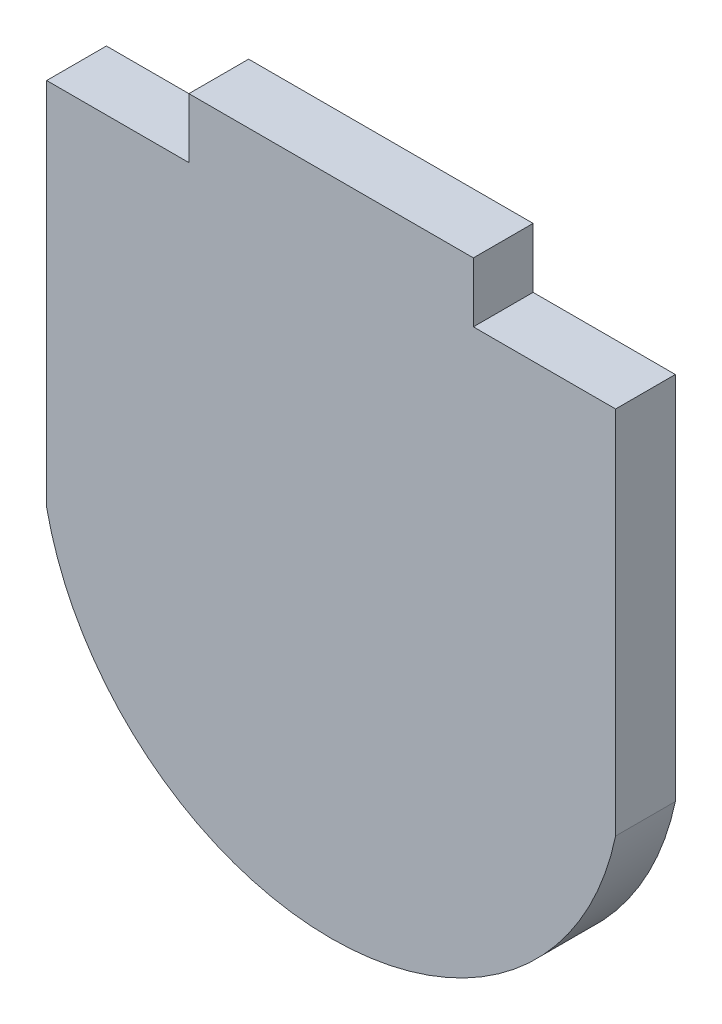
ISO-10303-21;
HEADER;
FILE_DESCRIPTION(('STEP AP214'),'2;1');
FILE_NAME('part.step','',(''),(''),'','','');
FILE_SCHEMA(('AUTOMOTIVE_DESIGN { 1 0 10303 214 1 1 1 1 }'));
ENDSEC;
DATA;
#1=APPLICATION_CONTEXT('core data for automotive mechanical design processes');
#2=APPLICATION_PROTOCOL_DEFINITION('international standard','automotive_design',2000,#1);
#3=PRODUCT_CONTEXT('',#1,'mechanical');
#4=PRODUCT('Part','Part','',(#3));
#5=PRODUCT_RELATED_PRODUCT_CATEGORY('part','',(#4));
#6=PRODUCT_DEFINITION_FORMATION('','',#4);
#7=PRODUCT_DEFINITION_CONTEXT('part definition',#1,'design');
#8=PRODUCT_DEFINITION('design','',#6,#7);
#9=PRODUCT_DEFINITION_SHAPE('','',#8);
#10=(LENGTH_UNIT() NAMED_UNIT(*) SI_UNIT(.MILLI.,.METRE.));
#11=(NAMED_UNIT(*) PLANE_ANGLE_UNIT() SI_UNIT($,.RADIAN.));
#12=(NAMED_UNIT(*) SI_UNIT($,.STERADIAN.) SOLID_ANGLE_UNIT());
#13=UNCERTAINTY_MEASURE_WITH_UNIT(LENGTH_MEASURE(1.E-05),#10,'distance_accuracy_value','');
#14=(GEOMETRIC_REPRESENTATION_CONTEXT(3) GLOBAL_UNCERTAINTY_ASSIGNED_CONTEXT((#13)) GLOBAL_UNIT_ASSIGNED_CONTEXT((#10,
#11,#12)) REPRESENTATION_CONTEXT('',''));
#15=CARTESIAN_POINT('',(0.,0.,0.));
#16=DIRECTION('',(0.,0.,1.));
#17=DIRECTION('',(1.,0.,0.));
#18=AXIS2_PLACEMENT_3D('',#15,#16,#17);
#19=CARTESIAN_POINT('',(-12.7210262479196,65.0700055953499,5.334));
#20=DIRECTION('',(0.,0.,-1.));
#21=DIRECTION('',(-1.,0.,0.));
#22=AXIS2_PLACEMENT_3D('',#19,#20,#21);
#23=CYLINDRICAL_SURFACE('',#22,25.9540277413738);
#24=CARTESIAN_POINT('',(-12.7210262479196,65.0700055953499,0.));
#25=DIRECTION('',(0.,0.,1.));
#26=DIRECTION('',(1.,0.,0.));
#27=AXIS2_PLACEMENT_3D('',#24,#25,#26);
#28=CIRCLE('',#27,25.9540277413738);
#29=CARTESIAN_POINT('',(-38.1210262479196,59.7360055953499,0.));
#30=VERTEX_POINT('',#29);
#31=CARTESIAN_POINT('',(12.6789737520804,59.7360055953498,0.));
#32=VERTEX_POINT('',#31);
#33=EDGE_CURVE('E122',#30,#32,#28,.T.);
#34=ORIENTED_EDGE('',*,*,#33,.T.);
#35=DIRECTION('',(0.,0.,-1.));
#36=VECTOR('',#35,1.);
#37=CARTESIAN_POINT('',(12.6789737520804,59.7360055953498,5.334));
#38=LINE('',#37,#36);
#39=CARTESIAN_POINT('',(12.6789737520804,59.7360055953498,5.334));
#40=VERTEX_POINT('',#39);
#41=EDGE_CURVE('E11',#40,#32,#38,.T.);
#42=ORIENTED_EDGE('',*,*,#41,.F.);
#43=CARTESIAN_POINT('',(-12.7210262479196,65.0700055953499,5.334));
#44=DIRECTION('',(0.,0.,1.));
#45=DIRECTION('',(1.,0.,0.));
#46=AXIS2_PLACEMENT_3D('',#43,#44,#45);
#47=CIRCLE('',#46,25.9540277413738);
#48=CARTESIAN_POINT('',(-38.1210262479196,59.7360055953499,5.334));
#49=VERTEX_POINT('',#48);
#50=EDGE_CURVE('E123',#49,#40,#47,.T.);
#51=ORIENTED_EDGE('',*,*,#50,.F.);
#52=DIRECTION('',(0.,0.,-1.));
#53=VECTOR('',#52,1.);
#54=CARTESIAN_POINT('',(-38.1210262479196,59.7360055953499,5.334));
#55=LINE('',#54,#53);
#56=EDGE_CURVE('E44',#49,#30,#55,.T.);
#57=ORIENTED_EDGE('',*,*,#56,.T.);
#58=EDGE_LOOP('',(#34,#42,#51,#57));
#59=FACE_BOUND('',#58,.T.);
#60=ADVANCED_FACE('F37',(#59),#23,.T.);
#61=CARTESIAN_POINT('',(12.6789737520804,98.0900055953499,5.334));
#62=DIRECTION('',(-1.,0.,0.));
#63=DIRECTION('',(0.,-1.,0.));
#64=AXIS2_PLACEMENT_3D('',#61,#62,#63);
#65=PLANE('',#64);
#66=DIRECTION('',(0.,1.,0.));
#67=VECTOR('',#66,1.);
#68=CARTESIAN_POINT('',(12.6789737520804,98.0900055953499,0.));
#69=LINE('',#68,#67);
#70=CARTESIAN_POINT('',(12.6789737520804,92.7560055953499,0.));
#71=VERTEX_POINT('',#70);
#72=EDGE_CURVE('E130',#32,#71,#69,.T.);
#73=ORIENTED_EDGE('',*,*,#72,.T.);
#74=DIRECTION('',(0.,0.,1.));
#75=VECTOR('',#74,1.);
#76=CARTESIAN_POINT('',(12.6789737520804,92.7560055953499,0.));
#77=LINE('',#76,#75);
#78=CARTESIAN_POINT('',(12.6789737520804,92.7560055953499,5.334));
#79=VERTEX_POINT('',#78);
#80=EDGE_CURVE('E147',#71,#79,#77,.T.);
#81=ORIENTED_EDGE('',*,*,#80,.T.);
#82=DIRECTION('',(0.,1.,0.));
#83=VECTOR('',#82,1.);
#84=CARTESIAN_POINT('',(12.6789737520804,98.0900055953499,5.334));
#85=LINE('',#84,#83);
#86=EDGE_CURVE('E127',#40,#79,#85,.T.);
#87=ORIENTED_EDGE('',*,*,#86,.F.);
#88=ORIENTED_EDGE('',*,*,#41,.T.);
#89=EDGE_LOOP('',(#73,#81,#87,#88));
#90=FACE_BOUND('',#89,.T.);
#91=ADVANCED_FACE('F146',(#90),#65,.F.);
#92=CARTESIAN_POINT('',(-38.1210262479196,98.0900055953499,5.334));
#93=DIRECTION('',(0.,-1.,0.));
#94=DIRECTION('',(0.,0.,-1.));
#95=AXIS2_PLACEMENT_3D('',#92,#93,#94);
#96=PLANE('',#95);
#97=DIRECTION('',(-1.,0.,0.));
#98=VECTOR('',#97,1.);
#99=CARTESIAN_POINT('',(-38.1210262479196,98.0900055953499,0.));
#100=LINE('',#99,#98);
#101=CARTESIAN_POINT('',(-0.0210262479196158,98.0900055953499,0.));
#102=VERTEX_POINT('',#101);
#103=CARTESIAN_POINT('',(-25.4210262479196,98.0900055953499,0.));
#104=VERTEX_POINT('',#103);
#105=EDGE_CURVE('E124',#102,#104,#100,.T.);
#106=ORIENTED_EDGE('',*,*,#105,.T.);
#107=DIRECTION('',(0.,0.,1.));
#108=VECTOR('',#107,1.);
#109=CARTESIAN_POINT('',(-25.4210262479196,98.0900055953499,0.));
#110=LINE('',#109,#108);
#111=CARTESIAN_POINT('',(-25.4210262479196,98.0900055953499,5.334));
#112=VERTEX_POINT('',#111);
#113=EDGE_CURVE('E142',#104,#112,#110,.T.);
#114=ORIENTED_EDGE('',*,*,#113,.T.);
#115=DIRECTION('',(-1.,0.,0.));
#116=VECTOR('',#115,1.);
#117=CARTESIAN_POINT('',(-38.1210262479196,98.0900055953499,5.334));
#118=LINE('',#117,#116);
#119=CARTESIAN_POINT('',(-0.0210262479196158,98.0900055953499,5.334));
#120=VERTEX_POINT('',#119);
#121=EDGE_CURVE('E135',#120,#112,#118,.T.);
#122=ORIENTED_EDGE('',*,*,#121,.F.);
#123=DIRECTION('',(0.,0.,1.));
#124=VECTOR('',#123,1.);
#125=CARTESIAN_POINT('',(-0.0210262479196158,98.0900055953499,0.));
#126=LINE('',#125,#124);
#127=EDGE_CURVE('E153',#102,#120,#126,.T.);
#128=ORIENTED_EDGE('',*,*,#127,.F.);
#129=EDGE_LOOP('',(#106,#114,#122,#128));
#130=FACE_BOUND('',#129,.T.);
#131=ADVANCED_FACE('F170',(#130),#96,.F.);
#132=CARTESIAN_POINT('',(-38.1210262479196,59.7360055953499,5.334));
#133=DIRECTION('',(1.,0.,0.));
#134=DIRECTION('',(0.,1.,0.));
#135=AXIS2_PLACEMENT_3D('',#132,#133,#134);
#136=PLANE('',#135);
#137=DIRECTION('',(0.,-1.,0.));
#138=VECTOR('',#137,1.);
#139=CARTESIAN_POINT('',(-38.1210262479196,59.7360055953499,5.334));
#140=LINE('',#139,#138);
#141=CARTESIAN_POINT('',(-38.1210262479196,92.7560055953499,5.334));
#142=VERTEX_POINT('',#141);
#143=EDGE_CURVE('E117',#142,#49,#140,.T.);
#144=ORIENTED_EDGE('',*,*,#143,.F.);
#145=DIRECTION('',(0.,0.,1.));
#146=VECTOR('',#145,1.);
#147=CARTESIAN_POINT('',(-38.1210262479196,92.7560055953499,0.));
#148=LINE('',#147,#146);
#149=CARTESIAN_POINT('',(-38.1210262479196,92.7560055953499,0.));
#150=VERTEX_POINT('',#149);
#151=EDGE_CURVE('E104',#150,#142,#148,.T.);
#152=ORIENTED_EDGE('',*,*,#151,.F.);
#153=DIRECTION('',(0.,-1.,0.));
#154=VECTOR('',#153,1.);
#155=CARTESIAN_POINT('',(-38.1210262479196,59.7360055953499,0.));
#156=LINE('',#155,#154);
#157=EDGE_CURVE('E115',#150,#30,#156,.T.);
#158=ORIENTED_EDGE('',*,*,#157,.T.);
#159=ORIENTED_EDGE('',*,*,#56,.F.);
#160=EDGE_LOOP('',(#144,#152,#158,#159));
#161=FACE_BOUND('',#160,.T.);
#162=ADVANCED_FACE('F113',(#161),#136,.F.);
#163=CARTESIAN_POINT('',(-12.7210262479196,65.0700055953499,5.334));
#164=DIRECTION('',(0.,0.,1.));
#165=DIRECTION('',(1.,0.,0.));
#166=AXIS2_PLACEMENT_3D('',#163,#164,#165);
#167=PLANE('',#166);
#168=DIRECTION('',(0.,1.,0.));
#169=VECTOR('',#168,1.);
#170=CARTESIAN_POINT('',(-25.4210262479196,98.0900055953499,5.334));
#171=LINE('',#170,#169);
#172=CARTESIAN_POINT('',(-25.4210262479196,92.7560055953499,5.334));
#173=VERTEX_POINT('',#172);
#174=EDGE_CURVE('E109',#173,#112,#171,.T.);
#175=ORIENTED_EDGE('',*,*,#174,.F.);
#176=DIRECTION('',(1.,0.,0.));
#177=VECTOR('',#176,1.);
#178=CARTESIAN_POINT('',(-38.1210262479196,92.7560055953499,5.334));
#179=LINE('',#178,#177);
#180=EDGE_CURVE('E197',#142,#173,#179,.T.);
#181=ORIENTED_EDGE('',*,*,#180,.F.);
#182=ORIENTED_EDGE('',*,*,#143,.T.);
#183=ORIENTED_EDGE('',*,*,#50,.T.);
#184=ORIENTED_EDGE('',*,*,#86,.T.);
#185=DIRECTION('',(1.,0.,0.));
#186=VECTOR('',#185,1.);
#187=CARTESIAN_POINT('',(12.6789737520804,92.7560055953499,5.334));
#188=LINE('',#187,#186);
#189=CARTESIAN_POINT('',(-0.0210262479196366,92.7560055953499,5.334));
#190=VERTEX_POINT('',#189);
#191=EDGE_CURVE('E155',#190,#79,#188,.T.);
#192=ORIENTED_EDGE('',*,*,#191,.F.);
#193=DIRECTION('',(0.,-1.,0.));
#194=VECTOR('',#193,1.);
#195=CARTESIAN_POINT('',(-0.0210262479196158,98.0900055953499,5.334));
#196=LINE('',#195,#194);
#197=EDGE_CURVE('E160',#120,#190,#196,.T.);
#198=ORIENTED_EDGE('',*,*,#197,.F.);
#199=ORIENTED_EDGE('',*,*,#121,.T.);
#200=EDGE_LOOP('',(#175,#181,#182,#183,#184,#192,#198,#199));
#201=FACE_BOUND('',#200,.T.);
#202=ADVANCED_FACE('F164',(#201),#167,.T.);
#203=CARTESIAN_POINT('',(-12.7210262479196,65.0700055953499,0.));
#204=DIRECTION('',(0.,0.,1.));
#205=DIRECTION('',(1.,0.,0.));
#206=AXIS2_PLACEMENT_3D('',#203,#204,#205);
#207=PLANE('',#206);
#208=DIRECTION('',(1.,0.,0.));
#209=VECTOR('',#208,1.);
#210=CARTESIAN_POINT('',(-38.1210262479196,92.7560055953499,0.));
#211=LINE('',#210,#209);
#212=CARTESIAN_POINT('',(-25.4210262479196,92.7560055953499,0.));
#213=VERTEX_POINT('',#212);
#214=EDGE_CURVE('E100',#150,#213,#211,.T.);
#215=ORIENTED_EDGE('',*,*,#214,.T.);
#216=DIRECTION('',(0.,1.,0.));
#217=VECTOR('',#216,1.);
#218=CARTESIAN_POINT('',(-25.4210262479196,98.0900055953499,0.));
#219=LINE('',#218,#217);
#220=EDGE_CURVE('E51',#213,#104,#219,.T.);
#221=ORIENTED_EDGE('',*,*,#220,.T.);
#222=ORIENTED_EDGE('',*,*,#105,.F.);
#223=DIRECTION('',(0.,-1.,0.));
#224=VECTOR('',#223,1.);
#225=CARTESIAN_POINT('',(-0.0210262479196158,98.0900055953499,0.));
#226=LINE('',#225,#224);
#227=CARTESIAN_POINT('',(-0.0210262479196361,92.7560055953499,0.));
#228=VERTEX_POINT('',#227);
#229=EDGE_CURVE('E152',#102,#228,#226,.T.);
#230=ORIENTED_EDGE('',*,*,#229,.T.);
#231=DIRECTION('',(1.,0.,0.));
#232=VECTOR('',#231,1.);
#233=CARTESIAN_POINT('',(12.6789737520804,92.7560055953499,0.));
#234=LINE('',#233,#232);
#235=EDGE_CURVE('E59',#228,#71,#234,.T.);
#236=ORIENTED_EDGE('',*,*,#235,.T.);
#237=ORIENTED_EDGE('',*,*,#72,.F.);
#238=ORIENTED_EDGE('',*,*,#33,.F.);
#239=ORIENTED_EDGE('',*,*,#157,.F.);
#240=EDGE_LOOP('',(#215,#221,#222,#230,#236,#237,#238,#239));
#241=FACE_BOUND('',#240,.T.);
#242=ADVANCED_FACE('F120',(#241),#207,.F.);
#243=CARTESIAN_POINT('',(12.6789737520804,92.7560055953499,0.));
#244=DIRECTION('',(0.,-1.,0.));
#245=DIRECTION('',(0.,0.,-1.));
#246=AXIS2_PLACEMENT_3D('',#243,#244,#245);
#247=PLANE('',#246);
#248=ORIENTED_EDGE('',*,*,#191,.T.);
#249=ORIENTED_EDGE('',*,*,#80,.F.);
#250=ORIENTED_EDGE('',*,*,#235,.F.);
#251=DIRECTION('',(0.,0.,1.));
#252=VECTOR('',#251,1.);
#253=CARTESIAN_POINT('',(-0.0210262479196366,92.7560055953499,0.));
#254=LINE('',#253,#252);
#255=EDGE_CURVE('E157',#228,#190,#254,.T.);
#256=ORIENTED_EDGE('',*,*,#255,.T.);
#257=EDGE_LOOP('',(#248,#249,#250,#256));
#258=FACE_BOUND('',#257,.T.);
#259=ADVANCED_FACE('F181',(#258),#247,.F.);
#260=CARTESIAN_POINT('',(-0.0210262479196158,98.0900055953499,0.));
#261=DIRECTION('',(-1.,0.,0.));
#262=DIRECTION('',(0.,-1.,0.));
#263=AXIS2_PLACEMENT_3D('',#260,#261,#262);
#264=PLANE('',#263);
#265=ORIENTED_EDGE('',*,*,#197,.T.);
#266=ORIENTED_EDGE('',*,*,#255,.F.);
#267=ORIENTED_EDGE('',*,*,#229,.F.);
#268=ORIENTED_EDGE('',*,*,#127,.T.);
#269=EDGE_LOOP('',(#265,#266,#267,#268));
#270=FACE_BOUND('',#269,.T.);
#271=ADVANCED_FACE('F186',(#270),#264,.F.);
#272=CARTESIAN_POINT('',(-25.4210262479196,98.0900055953499,0.));
#273=DIRECTION('',(1.,0.,0.));
#274=DIRECTION('',(0.,0.,-1.));
#275=AXIS2_PLACEMENT_3D('',#272,#273,#274);
#276=PLANE('',#275);
#277=ORIENTED_EDGE('',*,*,#174,.T.);
#278=ORIENTED_EDGE('',*,*,#113,.F.);
#279=ORIENTED_EDGE('',*,*,#220,.F.);
#280=DIRECTION('',(0.,0.,1.));
#281=VECTOR('',#280,1.);
#282=CARTESIAN_POINT('',(-25.4210262479196,92.7560055953499,0.));
#283=LINE('',#282,#281);
#284=EDGE_CURVE('E106',#213,#173,#283,.T.);
#285=ORIENTED_EDGE('',*,*,#284,.T.);
#286=EDGE_LOOP('',(#277,#278,#279,#285));
#287=FACE_BOUND('',#286,.T.);
#288=ADVANCED_FACE('F189',(#287),#276,.F.);
#289=CARTESIAN_POINT('',(-38.1210262479196,92.7560055953499,0.));
#290=DIRECTION('',(0.,-1.,0.));
#291=DIRECTION('',(0.,0.,-1.));
#292=AXIS2_PLACEMENT_3D('',#289,#290,#291);
#293=PLANE('',#292);
#294=ORIENTED_EDGE('',*,*,#180,.T.);
#295=ORIENTED_EDGE('',*,*,#284,.F.);
#296=ORIENTED_EDGE('',*,*,#214,.F.);
#297=ORIENTED_EDGE('',*,*,#151,.T.);
#298=EDGE_LOOP('',(#294,#295,#296,#297));
#299=FACE_BOUND('',#298,.T.);
#300=ADVANCED_FACE('F103',(#299),#293,.F.);
#301=CLOSED_SHELL('',(#60,#91,#131,#162,#202,#242,#259,#271,#288,#300));
#302=MANIFOLD_SOLID_BREP('B2',#301);
#303=ADVANCED_BREP_SHAPE_REPRESENTATION('',(#18,#302),#14);
#304=SHAPE_DEFINITION_REPRESENTATION(#9,#303);
ENDSEC;
END-ISO-10303-21;
